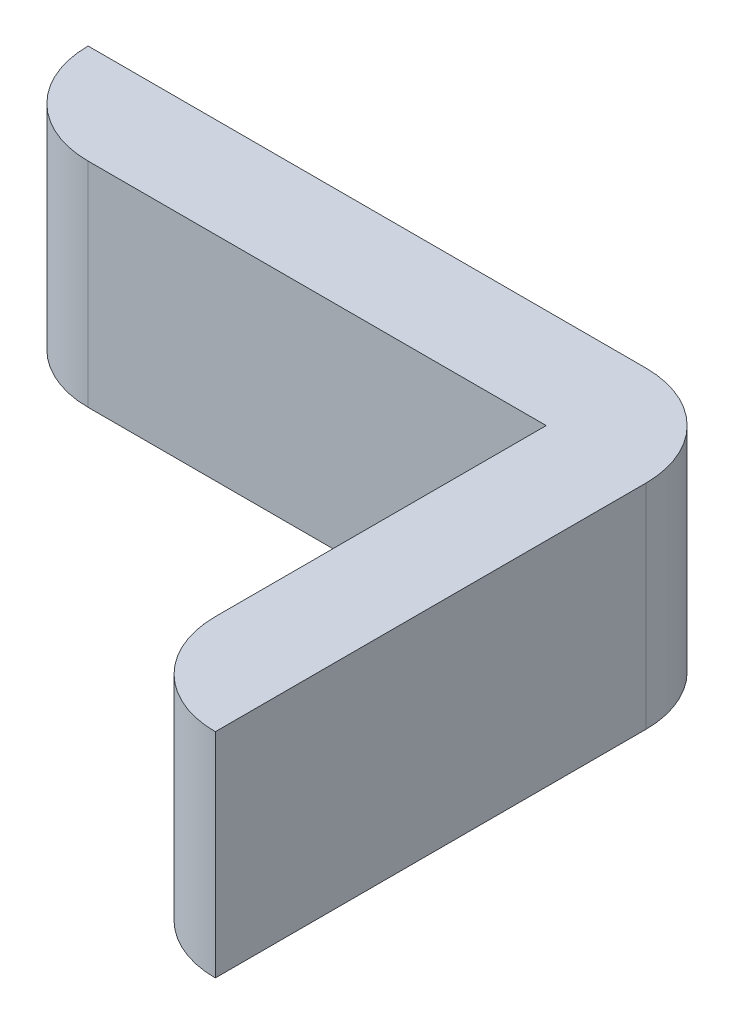
ISO-10303-21;
HEADER;
FILE_DESCRIPTION(('STEP AP214'),'2;1');
FILE_NAME('part.step','',(''),(''),'','','');
FILE_SCHEMA(('AUTOMOTIVE_DESIGN { 1 0 10303 214 1 1 1 1 }'));
ENDSEC;
DATA;
#1=APPLICATION_CONTEXT('core data for automotive mechanical design processes');
#2=APPLICATION_PROTOCOL_DEFINITION('international standard','automotive_design',2000,#1);
#3=PRODUCT_CONTEXT('',#1,'mechanical');
#4=PRODUCT('Part','Part','',(#3));
#5=PRODUCT_RELATED_PRODUCT_CATEGORY('part','',(#4));
#6=PRODUCT_DEFINITION_FORMATION('','',#4);
#7=PRODUCT_DEFINITION_CONTEXT('part definition',#1,'design');
#8=PRODUCT_DEFINITION('design','',#6,#7);
#9=PRODUCT_DEFINITION_SHAPE('','',#8);
#10=(LENGTH_UNIT() NAMED_UNIT(*) SI_UNIT(.MILLI.,.METRE.));
#11=(NAMED_UNIT(*) PLANE_ANGLE_UNIT() SI_UNIT($,.RADIAN.));
#12=(NAMED_UNIT(*) SI_UNIT($,.STERADIAN.) SOLID_ANGLE_UNIT());
#13=UNCERTAINTY_MEASURE_WITH_UNIT(LENGTH_MEASURE(1.E-05),#10,'distance_accuracy_value','');
#14=(GEOMETRIC_REPRESENTATION_CONTEXT(3) GLOBAL_UNCERTAINTY_ASSIGNED_CONTEXT((#13)) GLOBAL_UNIT_ASSIGNED_CONTEXT((#10,
#11,#12)) REPRESENTATION_CONTEXT('',''));
#15=CARTESIAN_POINT('',(0.,0.,0.));
#16=DIRECTION('',(0.,0.,1.));
#17=DIRECTION('',(1.,0.,0.));
#18=AXIS2_PLACEMENT_3D('',#15,#16,#17);
#19=CARTESIAN_POINT('',(-1.0795,-2.1725,1.33));
#20=DIRECTION('',(-1.,0.,0.));
#21=DIRECTION('',(0.,0.,1.));
#22=AXIS2_PLACEMENT_3D('',#19,#20,#21);
#23=PLANE('',#22);
#24=DIRECTION('',(0.,0.,-1.));
#25=VECTOR('',#24,1.);
#26=CARTESIAN_POINT('',(-1.0795,-2.1725,0.));
#27=LINE('',#26,#25);
#28=CARTESIAN_POINT('',(-1.0795,-2.1725,0.25));
#29=VERTEX_POINT('',#28);
#30=CARTESIAN_POINT('',(-1.0795,-2.1725,1.33));
#31=VERTEX_POINT('',#30);
#32=EDGE_CURVE('E129',#29,#31,#27,.F.);
#33=ORIENTED_EDGE('',*,*,#32,.F.);
#34=DIRECTION('',(0.,-1.,0.));
#35=VECTOR('',#34,1.);
#36=CARTESIAN_POINT('',(-1.0795,-2.1725,0.25));
#37=LINE('',#36,#35);
#38=CARTESIAN_POINT('',(-1.0795,-1.6375,0.25));
#39=VERTEX_POINT('',#38);
#40=EDGE_CURVE('E82',#39,#29,#37,.T.);
#41=ORIENTED_EDGE('',*,*,#40,.F.);
#42=DIRECTION('',(0.,0.,-1.));
#43=VECTOR('',#42,1.);
#44=CARTESIAN_POINT('',(-1.0795,-1.6375,0.));
#45=LINE('',#44,#43);
#46=CARTESIAN_POINT('',(-1.0795,-1.6375,1.33));
#47=VERTEX_POINT('',#46);
#48=EDGE_CURVE('E77',#39,#47,#45,.F.);
#49=ORIENTED_EDGE('',*,*,#48,.T.);
#50=DIRECTION('',(0.,-1.,0.));
#51=VECTOR('',#50,1.);
#52=CARTESIAN_POINT('',(-1.0795,-2.1725,1.33));
#53=LINE('',#52,#51);
#54=EDGE_CURVE('E123',#31,#47,#53,.F.);
#55=ORIENTED_EDGE('',*,*,#54,.F.);
#56=EDGE_LOOP('',(#33,#41,#49,#55));
#57=FACE_BOUND('',#56,.T.);
#58=ADVANCED_FACE('F17',(#57),#23,.F.);
#59=CARTESIAN_POINT('',(-1.0795,-2.1725,1.08));
#60=DIRECTION('',(0.,-1.,0.));
#61=DIRECTION('',(0.,0.,-1.));
#62=AXIS2_PLACEMENT_3D('',#59,#60,#61);
#63=CYLINDRICAL_SURFACE('',#62,0.25);
#64=CARTESIAN_POINT('',(-1.0795,-1.6375,1.08));
#65=DIRECTION('',(0.,-1.,0.));
#66=DIRECTION('',(0.,0.,-1.));
#67=AXIS2_PLACEMENT_3D('',#64,#65,#66);
#68=CIRCLE('',#67,0.25);
#69=CARTESIAN_POINT('',(-1.3295,-1.6375,1.08));
#70=VERTEX_POINT('',#69);
#71=EDGE_CURVE('E107',#47,#70,#68,.T.);
#72=ORIENTED_EDGE('',*,*,#71,.T.);
#73=DIRECTION('',(0.,1.,0.));
#74=VECTOR('',#73,1.);
#75=CARTESIAN_POINT('',(-1.3295,-2.1725,1.08));
#76=LINE('',#75,#74);
#77=CARTESIAN_POINT('',(-1.3295,-2.1725,1.08));
#78=VERTEX_POINT('',#77);
#79=EDGE_CURVE('E118',#70,#78,#76,.F.);
#80=ORIENTED_EDGE('',*,*,#79,.T.);
#81=CARTESIAN_POINT('',(-1.0795,-2.1725,1.08));
#82=DIRECTION('',(0.,-1.,0.));
#83=DIRECTION('',(0.,0.,-1.));
#84=AXIS2_PLACEMENT_3D('',#81,#82,#83);
#85=CIRCLE('',#84,0.25);
#86=EDGE_CURVE('E126',#31,#78,#85,.T.);
#87=ORIENTED_EDGE('',*,*,#86,.F.);
#88=ORIENTED_EDGE('',*,*,#54,.T.);
#89=EDGE_LOOP('',(#72,#80,#87,#88));
#90=FACE_BOUND('',#89,.T.);
#91=ADVANCED_FACE('F133',(#90),#63,.T.);
#92=CARTESIAN_POINT('',(-1.3295,-2.1725,0.25));
#93=DIRECTION('',(1.,0.,0.));
#94=DIRECTION('',(0.,0.,-1.));
#95=AXIS2_PLACEMENT_3D('',#92,#93,#94);
#96=PLANE('',#95);
#97=ORIENTED_EDGE('',*,*,#79,.F.);
#98=DIRECTION('',(0.,0.,-1.));
#99=VECTOR('',#98,1.);
#100=CARTESIAN_POINT('',(-1.3295,-1.6375,0.));
#101=LINE('',#100,#99);
#102=CARTESIAN_POINT('',(-1.3295,-1.6375,0.25));
#103=VERTEX_POINT('',#102);
#104=EDGE_CURVE('E102',#70,#103,#101,.T.);
#105=ORIENTED_EDGE('',*,*,#104,.T.);
#106=DIRECTION('',(0.,1.,0.));
#107=VECTOR('',#106,1.);
#108=CARTESIAN_POINT('',(-1.3295,-2.1725,0.25));
#109=LINE('',#108,#107);
#110=CARTESIAN_POINT('',(-1.3295,-2.1725,0.25));
#111=VERTEX_POINT('',#110);
#112=EDGE_CURVE('E115',#103,#111,#109,.F.);
#113=ORIENTED_EDGE('',*,*,#112,.T.);
#114=DIRECTION('',(0.,0.,-1.));
#115=VECTOR('',#114,1.);
#116=CARTESIAN_POINT('',(-1.3295,-2.1725,0.));
#117=LINE('',#116,#115);
#118=EDGE_CURVE('E128',#78,#111,#117,.T.);
#119=ORIENTED_EDGE('',*,*,#118,.F.);
#120=EDGE_LOOP('',(#97,#105,#113,#119));
#121=FACE_BOUND('',#120,.T.);
#122=ADVANCED_FACE('F158',(#121),#96,.F.);
#123=CARTESIAN_POINT('',(-2.4785,-2.1725,0.25));
#124=DIRECTION('',(0.,0.,-1.));
#125=DIRECTION('',(-1.,0.,0.));
#126=AXIS2_PLACEMENT_3D('',#123,#124,#125);
#127=PLANE('',#126);
#128=ORIENTED_EDGE('',*,*,#112,.F.);
#129=DIRECTION('',(1.,0.,0.));
#130=VECTOR('',#129,1.);
#131=CARTESIAN_POINT('',(-2.7285,-1.6375,0.25));
#132=LINE('',#131,#130);
#133=CARTESIAN_POINT('',(-2.4785,-1.6375,0.25));
#134=VERTEX_POINT('',#133);
#135=EDGE_CURVE('E98',#103,#134,#132,.F.);
#136=ORIENTED_EDGE('',*,*,#135,.T.);
#137=DIRECTION('',(0.,-1.,0.));
#138=VECTOR('',#137,1.);
#139=CARTESIAN_POINT('',(-2.4785,-2.1725,0.25));
#140=LINE('',#139,#138);
#141=CARTESIAN_POINT('',(-2.4785,-2.1725,0.25));
#142=VERTEX_POINT('',#141);
#143=EDGE_CURVE('E101',#142,#134,#140,.F.);
#144=ORIENTED_EDGE('',*,*,#143,.F.);
#145=DIRECTION('',(1.,0.,0.));
#146=VECTOR('',#145,1.);
#147=CARTESIAN_POINT('',(-2.7285,-2.1725,0.25));
#148=LINE('',#147,#146);
#149=EDGE_CURVE('E94',#111,#142,#148,.F.);
#150=ORIENTED_EDGE('',*,*,#149,.F.);
#151=EDGE_LOOP('',(#128,#136,#144,#150));
#152=FACE_BOUND('',#151,.T.);
#153=ADVANCED_FACE('F156',(#152),#127,.F.);
#154=CARTESIAN_POINT('',(-1.3295,-2.1725,0.25));
#155=DIRECTION('',(0.,-1.,0.));
#156=DIRECTION('',(0.,0.,-1.));
#157=AXIS2_PLACEMENT_3D('',#154,#155,#156);
#158=CYLINDRICAL_SURFACE('',#157,0.25);
#159=CARTESIAN_POINT('',(-1.3295,-1.6375,0.25));
#160=DIRECTION('',(0.,-1.,0.));
#161=DIRECTION('',(0.,0.,-1.));
#162=AXIS2_PLACEMENT_3D('',#159,#160,#161);
#163=CIRCLE('',#162,0.25);
#164=CARTESIAN_POINT('',(-1.3295,-1.6375,0.));
#165=VERTEX_POINT('',#164);
#166=EDGE_CURVE('E20',#165,#39,#163,.T.);
#167=ORIENTED_EDGE('',*,*,#166,.T.);
#168=ORIENTED_EDGE('',*,*,#40,.T.);
#169=CARTESIAN_POINT('',(-1.3295,-2.1725,0.25));
#170=DIRECTION('',(0.,-1.,0.));
#171=DIRECTION('',(0.,0.,-1.));
#172=AXIS2_PLACEMENT_3D('',#169,#170,#171);
#173=CIRCLE('',#172,0.25);
#174=CARTESIAN_POINT('',(-1.3295,-2.1725,0.));
#175=VERTEX_POINT('',#174);
#176=EDGE_CURVE('E92',#175,#29,#173,.T.);
#177=ORIENTED_EDGE('',*,*,#176,.F.);
#178=DIRECTION('',(0.,1.,0.));
#179=VECTOR('',#178,1.);
#180=CARTESIAN_POINT('',(-1.3295,-2.1725,0.));
#181=LINE('',#180,#179);
#182=EDGE_CURVE('E86',#175,#165,#181,.T.);
#183=ORIENTED_EDGE('',*,*,#182,.T.);
#184=EDGE_LOOP('',(#167,#168,#177,#183));
#185=FACE_BOUND('',#184,.T.);
#186=ADVANCED_FACE('F90',(#185),#158,.T.);
#187=CARTESIAN_POINT('',(-2.7285,-1.6375,0.));
#188=DIRECTION('',(0.,-1.,0.));
#189=DIRECTION('',(0.,0.,-1.));
#190=AXIS2_PLACEMENT_3D('',#187,#188,#189);
#191=PLANE('',#190);
#192=ORIENTED_EDGE('',*,*,#135,.F.);
#193=ORIENTED_EDGE('',*,*,#104,.F.);
#194=ORIENTED_EDGE('',*,*,#71,.F.);
#195=ORIENTED_EDGE('',*,*,#48,.F.);
#196=ORIENTED_EDGE('',*,*,#166,.F.);
#197=DIRECTION('',(1.,0.,0.));
#198=VECTOR('',#197,1.);
#199=CARTESIAN_POINT('',(-1.3295,-1.6375,0.));
#200=LINE('',#199,#198);
#201=CARTESIAN_POINT('',(-2.7285,-1.6375,0.));
#202=VERTEX_POINT('',#201);
#203=EDGE_CURVE('E74',#165,#202,#200,.F.);
#204=ORIENTED_EDGE('',*,*,#203,.T.);
#205=CARTESIAN_POINT('',(-2.4785,-1.6375,0.));
#206=DIRECTION('',(0.,-1.,0.));
#207=DIRECTION('',(0.,0.,-1.));
#208=AXIS2_PLACEMENT_3D('',#205,#206,#207);
#209=CIRCLE('',#208,0.25);
#210=EDGE_CURVE('E114',#134,#202,#209,.T.);
#211=ORIENTED_EDGE('',*,*,#210,.F.);
#212=EDGE_LOOP('',(#192,#193,#194,#195,#196,#204,#211));
#213=FACE_BOUND('',#212,.T.);
#214=ADVANCED_FACE('F72',(#213),#191,.F.);
#215=CARTESIAN_POINT('',(-2.4785,-2.1725,0.));
#216=DIRECTION('',(0.,-1.,0.));
#217=DIRECTION('',(0.,0.,-1.));
#218=AXIS2_PLACEMENT_3D('',#215,#216,#217);
#219=CYLINDRICAL_SURFACE('',#218,0.25);
#220=ORIENTED_EDGE('',*,*,#210,.T.);
#221=DIRECTION('',(0.,1.,0.));
#222=VECTOR('',#221,1.);
#223=CARTESIAN_POINT('',(-2.7285,-2.1725,0.));
#224=LINE('',#223,#222);
#225=CARTESIAN_POINT('',(-2.7285,-2.1725,0.));
#226=VERTEX_POINT('',#225);
#227=EDGE_CURVE('E26',#202,#226,#224,.F.);
#228=ORIENTED_EDGE('',*,*,#227,.T.);
#229=CARTESIAN_POINT('',(-2.4785,-2.1725,0.));
#230=DIRECTION('',(0.,-1.,0.));
#231=DIRECTION('',(0.,0.,-1.));
#232=AXIS2_PLACEMENT_3D('',#229,#230,#231);
#233=CIRCLE('',#232,0.25);
#234=EDGE_CURVE('E34',#142,#226,#233,.T.);
#235=ORIENTED_EDGE('',*,*,#234,.F.);
#236=ORIENTED_EDGE('',*,*,#143,.T.);
#237=EDGE_LOOP('',(#220,#228,#235,#236));
#238=FACE_BOUND('',#237,.T.);
#239=ADVANCED_FACE('F141',(#238),#219,.T.);
#240=CARTESIAN_POINT('',(-2.7285,-2.1725,0.));
#241=DIRECTION('',(0.,-1.,0.));
#242=DIRECTION('',(0.,0.,-1.));
#243=AXIS2_PLACEMENT_3D('',#240,#241,#242);
#244=PLANE('',#243);
#245=ORIENTED_EDGE('',*,*,#149,.T.);
#246=ORIENTED_EDGE('',*,*,#234,.T.);
#247=DIRECTION('',(1.,0.,0.));
#248=VECTOR('',#247,1.);
#249=CARTESIAN_POINT('',(-1.3295,-2.1725,0.));
#250=LINE('',#249,#248);
#251=EDGE_CURVE('E11',#226,#175,#250,.T.);
#252=ORIENTED_EDGE('',*,*,#251,.T.);
#253=ORIENTED_EDGE('',*,*,#176,.T.);
#254=ORIENTED_EDGE('',*,*,#32,.T.);
#255=ORIENTED_EDGE('',*,*,#86,.T.);
#256=ORIENTED_EDGE('',*,*,#118,.T.);
#257=EDGE_LOOP('',(#245,#246,#252,#253,#254,#255,#256));
#258=FACE_BOUND('',#257,.T.);
#259=ADVANCED_FACE('F139',(#258),#244,.T.);
#260=CARTESIAN_POINT('',(-1.3295,-2.1725,0.));
#261=DIRECTION('',(0.,0.,1.));
#262=DIRECTION('',(1.,0.,0.));
#263=AXIS2_PLACEMENT_3D('',#260,#261,#262);
#264=PLANE('',#263);
#265=ORIENTED_EDGE('',*,*,#227,.F.);
#266=ORIENTED_EDGE('',*,*,#203,.F.);
#267=ORIENTED_EDGE('',*,*,#182,.F.);
#268=ORIENTED_EDGE('',*,*,#251,.F.);
#269=EDGE_LOOP('',(#265,#266,#267,#268));
#270=FACE_BOUND('',#269,.T.);
#271=ADVANCED_FACE('F85',(#270),#264,.F.);
#272=CLOSED_SHELL('',(#58,#91,#122,#153,#186,#214,#239,#259,#271));
#273=MANIFOLD_SOLID_BREP('B1',#272);
#274=ADVANCED_BREP_SHAPE_REPRESENTATION('',(#18,#273),#14);
#275=SHAPE_DEFINITION_REPRESENTATION(#9,#274);
ENDSEC;
END-ISO-10303-21;
